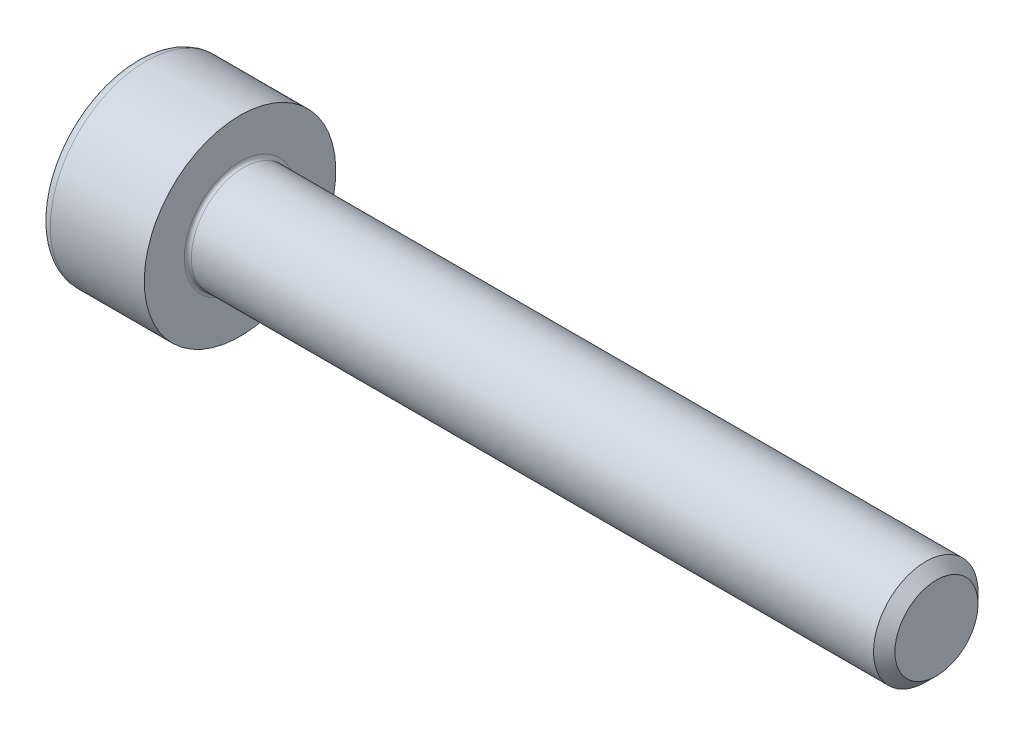
ISO-10303-21;
HEADER;
FILE_DESCRIPTION(('STEP AP214'),'2;1');
FILE_NAME('part.step','',(''),(''),'','','');
FILE_SCHEMA(('AUTOMOTIVE_DESIGN { 1 0 10303 214 1 1 1 1 }'));
ENDSEC;
DATA;
#1=APPLICATION_CONTEXT('core data for automotive mechanical design processes');
#2=APPLICATION_PROTOCOL_DEFINITION('international standard','automotive_design',2000,#1);
#3=PRODUCT_CONTEXT('',#1,'mechanical');
#4=PRODUCT('Part','Part','',(#3));
#5=PRODUCT_RELATED_PRODUCT_CATEGORY('part','',(#4));
#6=PRODUCT_DEFINITION_FORMATION('','',#4);
#7=PRODUCT_DEFINITION_CONTEXT('part definition',#1,'design');
#8=PRODUCT_DEFINITION('design','',#6,#7);
#9=PRODUCT_DEFINITION_SHAPE('','',#8);
#10=(LENGTH_UNIT() NAMED_UNIT(*) SI_UNIT(.MILLI.,.METRE.));
#11=(NAMED_UNIT(*) PLANE_ANGLE_UNIT() SI_UNIT($,.RADIAN.));
#12=(NAMED_UNIT(*) SI_UNIT($,.STERADIAN.) SOLID_ANGLE_UNIT());
#13=UNCERTAINTY_MEASURE_WITH_UNIT(LENGTH_MEASURE(1.E-05),#10,'distance_accuracy_value','');
#14=(GEOMETRIC_REPRESENTATION_CONTEXT(3) GLOBAL_UNCERTAINTY_ASSIGNED_CONTEXT((#13)) GLOBAL_UNIT_ASSIGNED_CONTEXT((#10,
#11,#12)) REPRESENTATION_CONTEXT('',''));
#15=CARTESIAN_POINT('',(0.,0.,0.));
#16=DIRECTION('',(0.,0.,1.));
#17=DIRECTION('',(1.,0.,0.));
#18=AXIS2_PLACEMENT_3D('',#15,#16,#17);
#19=CARTESIAN_POINT('',(-1.50499999995191,0.,0.));
#20=DIRECTION('',(-1.,0.,0.));
#21=DIRECTION('',(0.,0.,1.));
#22=AXIS2_PLACEMENT_3D('',#19,#20,#21);
#23=CONICAL_SURFACE('',#22,1.45203592694543,1.04719755118368);
#24=CARTESIAN_POINT('',(-0.666666666631954,0.,0.));
#25=VERTEX_POINT('',#24);
#26=VERTEX_LOOP('',#25);
#27=FACE_BOUND('',#26,.T.);
#28=CARTESIAN_POINT('',(-1.4999999999909,1.25,0.721687836489657));
#29=CARTESIAN_POINT('',(-1.4816847156944,1.25,0.658260217060659));
#30=CARTESIAN_POINT('',(-1.46502792317726,1.25,0.594285091323054));
#31=CARTESIAN_POINT('',(-1.43595399211371,1.25,0.465227153339786));
#32=CARTESIAN_POINT('',(-1.42354713769938,1.25,0.400142048730784));
#33=CARTESIAN_POINT('',(-1.40423497432866,1.25,0.270778406587784));
#34=CARTESIAN_POINT('',(-1.39720111723517,1.25,0.206519767732602));
#35=CARTESIAN_POINT('',(-1.38880573006833,1.25,0.0777002896417235));
#36=CARTESIAN_POINT('',(-1.38743724622064,1.25,0.0131399183085284));
#37=CARTESIAN_POINT('',(-1.39029143133364,1.25,-0.107484209657786));
#38=CARTESIAN_POINT('',(-1.3938133032472,1.25,-0.163566066924007));
#39=CARTESIAN_POINT('',(-1.40497331293631,1.25,-0.275364426449888));
#40=CARTESIAN_POINT('',(-1.41261525921817,1.25,-0.33108054231749));
#41=CARTESIAN_POINT('',(-1.43171864582492,1.25,-0.443109217007412));
#42=CARTESIAN_POINT('',(-1.44326102637533,1.25,-0.499407604241769));
#43=CARTESIAN_POINT('',(-1.46945735051443,1.25,-0.611164931123502));
#44=CARTESIAN_POINT('',(-1.48410514296048,1.25,-0.666625301406957));
#45=CARTESIAN_POINT('',(-1.4999999999909,1.25,-0.721687836489659));
#46=B_SPLINE_CURVE_WITH_KNOTS('',3,(#28,#29,#30,#31,#32,#33,#34,#35,#36,#37,#38,#39,#40,#41,#42,
#43,#44,#45),.UNSPECIFIED.,.F.,.F.,(4,2,2,2,2,2,2,2,4),(0.,0.198135007224197,0.39674613564431,
0.590442253848804,0.783900555565205,0.952317364149541,1.12089012112667,1.29320101406139,
1.4651737334536),.UNSPECIFIED.);
#47=CARTESIAN_POINT('',(-1.4999999999909,1.25000000000114,0.72168783648769));
#48=VERTEX_POINT('',#47);
#49=CARTESIAN_POINT('',(-1.49999999999052,1.25,-0.721687836488346));
#50=VERTEX_POINT('',#49);
#51=EDGE_CURVE('E20',#48,#50,#46,.T.);
#52=ORIENTED_EDGE('',*,*,#51,.T.);
#53=CARTESIAN_POINT('',(-1.4999999999909,1.25000000000227,-0.721687836485722));
#54=CARTESIAN_POINT('',(-1.4816847156944,1.19507007027519,-0.753401646200221));
#55=CARTESIAN_POINT('',(-1.46502792317726,1.13966598617612,-0.785389209069024));
#56=CARTESIAN_POINT('',(-1.43595399211371,1.02789853332257,-0.849918178060657));
#57=CARTESIAN_POINT('',(-1.42354713769938,0.971533179323208,-0.882460730365158));
#58=CARTESIAN_POINT('',(-1.40423497432866,0.859500978901291,-0.947142551436658));
#59=CARTESIAN_POINT('',(-1.39720111723517,0.803851365240094,-0.979271870864249));
#60=CARTESIAN_POINT('',(-1.38880573006833,0.69229042471114,-1.04368160990969));
#61=CARTESIAN_POINT('',(-1.38743724622064,0.636379503058836,-1.07596179557629));
#62=CARTESIAN_POINT('',(-1.39029143133364,0.531915943930663,-1.13627385955944));
#63=CARTESIAN_POINT('',(-1.3938133032472,0.483347630846703,-1.16431478819255));
#64=CARTESIAN_POINT('',(-1.40497331293631,0.386527411395864,-1.22021396795549));
#65=CARTESIAN_POINT('',(-1.41261525921817,0.338275839654324,-1.24807202588929));
#66=CARTESIAN_POINT('',(-1.43171864582492,0.241256161420549,-1.30408636323426));
#67=CARTESIAN_POINT('',(-1.44326102637533,0.192500327883502,-1.33223555685143));
#68=CARTESIAN_POINT('',(-1.46945735051443,0.0957156437448804,-1.3881142202923));
#69=CARTESIAN_POINT('',(-1.48410514296048,0.0476855541761164,-1.41584440543403));
#70=CARTESIAN_POINT('',(-1.4999999999909,-2.27522422515546E-12,-1.44337567297538));
#71=B_SPLINE_CURVE_WITH_KNOTS('',3,(#53,#54,#55,#56,#57,#58,#59,#60,#61,#62,#63,#64,#65,#66,#67,
#68,#69,#70),.UNSPECIFIED.,.F.,.F.,(4,2,2,2,2,2,2,2,4),(0.,0.198135007224197,0.39674613564431,
0.590442253848803,0.783900555565204,0.95231736414954,1.12089012112666,1.29320101406138,
1.46517373345359),.UNSPECIFIED.);
#72=CARTESIAN_POINT('',(-1.4999999999909,0.,-1.44337567297538));
#73=VERTEX_POINT('',#72);
#74=EDGE_CURVE('E81',#50,#73,#71,.T.);
#75=ORIENTED_EDGE('',*,*,#74,.T.);
#76=CARTESIAN_POINT('',(-1.4999999999909,2.27005244620297E-12,-1.44337567297538));
#77=CARTESIAN_POINT('',(-1.4816847156944,-0.0549299297248149,-1.41166186326088));
#78=CARTESIAN_POINT('',(-1.46502792317727,-0.110334013823884,-1.37967430039208));
#79=CARTESIAN_POINT('',(-1.43595399211371,-0.222101466677431,-1.31514533140045));
#80=CARTESIAN_POINT('',(-1.42354713769938,-0.278466820676794,-1.28260277909594));
#81=CARTESIAN_POINT('',(-1.40423497432866,-0.390499021098712,-1.21792095802444));
#82=CARTESIAN_POINT('',(-1.39720111723517,-0.446148634759909,-1.18579163859685));
#83=CARTESIAN_POINT('',(-1.38880573006834,-0.557709575288864,-1.12138189955141));
#84=CARTESIAN_POINT('',(-1.38743724622064,-0.613620496941167,-1.08910171388482));
#85=CARTESIAN_POINT('',(-1.39029143133364,-0.718084056069341,-1.02878964990166));
#86=CARTESIAN_POINT('',(-1.3938133032472,-0.7666523691533,-1.00074872126855));
#87=CARTESIAN_POINT('',(-1.40497331293632,-0.863472588604139,-0.944849541505608));
#88=CARTESIAN_POINT('',(-1.41261525921817,-0.911724160345678,-0.916991483571808));
#89=CARTESIAN_POINT('',(-1.43171864582492,-1.00874383857945,-0.860977146226847));
#90=CARTESIAN_POINT('',(-1.44326102637533,-1.0574996721165,-0.832827952609669));
#91=CARTESIAN_POINT('',(-1.46945735051443,-1.15428435625512,-0.776949289168803));
#92=CARTESIAN_POINT('',(-1.48410514296048,-1.20231444582388,-0.749219104027075));
#93=CARTESIAN_POINT('',(-1.4999999999909,-1.25000000000228,-0.721687836485724));
#94=B_SPLINE_CURVE_WITH_KNOTS('',3,(#76,#77,#78,#79,#80,#81,#82,#83,#84,#85,#86,#87,#88,#89,#90,
#91,#92,#93),.UNSPECIFIED.,.F.,.F.,(4,2,2,2,2,2,2,2,4),(0.,0.198135007224197,0.396746135644311,
0.590442253848805,0.783900555565207,0.952317364149541,1.12089012112666,1.29320101406138,
1.46517373345359),.UNSPECIFIED.);
#95=CARTESIAN_POINT('',(-1.4999999999909,-1.25000000000114,-0.721687836487692));
#96=VERTEX_POINT('',#95);
#97=EDGE_CURVE('E112',#73,#96,#94,.T.);
#98=ORIENTED_EDGE('',*,*,#97,.T.);
#99=CARTESIAN_POINT('',(-1.4999999999909,-1.25,-0.721687836489659));
#100=CARTESIAN_POINT('',(-1.4816847156944,-1.25,-0.65826021706066));
#101=CARTESIAN_POINT('',(-1.46502792317726,-1.25,-0.594285091323056));
#102=CARTESIAN_POINT('',(-1.43595399211371,-1.25,-0.465227153339788));
#103=CARTESIAN_POINT('',(-1.42354713769938,-1.25,-0.400142048730786));
#104=CARTESIAN_POINT('',(-1.40423497432866,-1.25,-0.270778406587786));
#105=CARTESIAN_POINT('',(-1.39720111723517,-1.25,-0.206519767732604));
#106=CARTESIAN_POINT('',(-1.38880573006833,-1.25,-0.0777002896417252));
#107=CARTESIAN_POINT('',(-1.38743724622064,-1.25,-0.0131399183085301));
#108=CARTESIAN_POINT('',(-1.39029143133364,-1.25,0.107484209657785));
#109=CARTESIAN_POINT('',(-1.3938133032472,-1.25,0.163566066924005));
#110=CARTESIAN_POINT('',(-1.40497331293631,-1.25,0.275364426449886));
#111=CARTESIAN_POINT('',(-1.41261525921817,-1.25,0.331080542317488));
#112=CARTESIAN_POINT('',(-1.43171864582492,-1.25,0.44310921700741));
#113=CARTESIAN_POINT('',(-1.44326102637533,-1.25,0.499407604241767));
#114=CARTESIAN_POINT('',(-1.46945735051443,-1.25,0.6111649311235));
#115=CARTESIAN_POINT('',(-1.48410514296048,-1.25,0.666625301406955));
#116=CARTESIAN_POINT('',(-1.4999999999909,-1.25,0.721687836489657));
#117=B_SPLINE_CURVE_WITH_KNOTS('',3,(#99,#100,#101,#102,#103,#104,#105,#106,#107,#108,#109,#110,
#111,#112,#113,#114,#115,#116),.UNSPECIFIED.,.F.,.F.,(4,2,2,2,2,2,2,2,4),(0.,0.198135007224197,
0.39674613564431,0.590442253848804,0.783900555565205,0.952317364149541,1.12089012112667,
1.29320101406139,1.4651737334536),.UNSPECIFIED.);
#118=CARTESIAN_POINT('',(-1.4999999999909,-1.25000000000114,0.721687836487689));
#119=VERTEX_POINT('',#118);
#120=EDGE_CURVE('E136',#96,#119,#117,.T.);
#121=ORIENTED_EDGE('',*,*,#120,.T.);
#122=CARTESIAN_POINT('',(-1.4999999999909,-1.25000000000227,0.72168783648572));
#123=CARTESIAN_POINT('',(-1.4816847156944,-1.19507007027519,0.75340164620022));
#124=CARTESIAN_POINT('',(-1.46502792317727,-1.13966598617612,0.785389209069022));
#125=CARTESIAN_POINT('',(-1.43595399211371,-1.02789853332257,0.849918178060656));
#126=CARTESIAN_POINT('',(-1.42354713769938,-0.97153317932321,0.882460730365157));
#127=CARTESIAN_POINT('',(-1.40423497432866,-0.859500978901293,0.947142551436657));
#128=CARTESIAN_POINT('',(-1.39720111723517,-0.803851365240095,0.979271870864248));
#129=CARTESIAN_POINT('',(-1.38880573006833,-0.692290424711142,1.04368160990969));
#130=CARTESIAN_POINT('',(-1.38743724622064,-0.636379503058838,1.07596179557629));
#131=CARTESIAN_POINT('',(-1.39029143133364,-0.531915943930664,1.13627385955944));
#132=CARTESIAN_POINT('',(-1.3938133032472,-0.483347630846704,1.16431478819255));
#133=CARTESIAN_POINT('',(-1.40497331293631,-0.386527411395865,1.22021396795549));
#134=CARTESIAN_POINT('',(-1.41261525921817,-0.338275839654325,1.24807202588929));
#135=CARTESIAN_POINT('',(-1.43171864582492,-0.24125616142055,1.30408636323425));
#136=CARTESIAN_POINT('',(-1.44326102637533,-0.192500327883503,1.33223555685143));
#137=CARTESIAN_POINT('',(-1.46945735051443,-0.0957156437448812,1.3881142202923));
#138=CARTESIAN_POINT('',(-1.48410514296048,-0.047685554176117,1.41584440543403));
#139=CARTESIAN_POINT('',(-1.4999999999909,2.27457887045116E-12,1.44337567297538));
#140=B_SPLINE_CURVE_WITH_KNOTS('',3,(#122,#123,#124,#125,#126,#127,#128,#129,#130,#131,#132,
#133,#134,#135,#136,#137,#138,#139),.UNSPECIFIED.,.F.,.F.,(4,2,2,2,2,2,2,2,4),(0.,
0.198135007224197,0.39674613564431,0.590442253848804,0.783900555565205,0.95231736414954,
1.12089012112667,1.29320101406139,1.4651737334536),.UNSPECIFIED.);
#141=CARTESIAN_POINT('',(-1.4999999999909,0.,1.44337567297538));
#142=VERTEX_POINT('',#141);
#143=EDGE_CURVE('E145',#119,#142,#140,.T.);
#144=ORIENTED_EDGE('',*,*,#143,.T.);
#145=CARTESIAN_POINT('',(-1.4999999999909,-2.27088715746638E-12,1.44337567297538));
#146=CARTESIAN_POINT('',(-1.4816847156944,0.0549299297248139,1.41166186326088));
#147=CARTESIAN_POINT('',(-1.46502792317727,0.110334013823883,1.37967430039208));
#148=CARTESIAN_POINT('',(-1.43595399211371,0.22210146667743,1.31514533140045));
#149=CARTESIAN_POINT('',(-1.42354713769938,0.278466820676793,1.28260277909594));
#150=CARTESIAN_POINT('',(-1.40423497432866,0.390499021098711,1.21792095802444));
#151=CARTESIAN_POINT('',(-1.39720111723517,0.446148634759908,1.18579163859685));
#152=CARTESIAN_POINT('',(-1.38880573006834,0.557709575288863,1.12138189955141));
#153=CARTESIAN_POINT('',(-1.38743724622064,0.613620496941166,1.08910171388481));
#154=CARTESIAN_POINT('',(-1.39029143133364,0.71808405606934,1.02878964990166));
#155=CARTESIAN_POINT('',(-1.3938133032472,0.766652369153299,1.00074872126855));
#156=CARTESIAN_POINT('',(-1.40497331293632,0.863472588604138,0.944849541505607));
#157=CARTESIAN_POINT('',(-1.41261525921817,0.911724160345677,0.916991483571806));
#158=CARTESIAN_POINT('',(-1.43171864582492,1.00874383857945,0.860977146226845));
#159=CARTESIAN_POINT('',(-1.44326102637533,1.0574996721165,0.832827952609667));
#160=CARTESIAN_POINT('',(-1.46945735051443,1.15428435625512,0.776949289168801));
#161=CARTESIAN_POINT('',(-1.48410514296048,1.20231444582388,0.749219104027073));
#162=CARTESIAN_POINT('',(-1.4999999999909,1.25000000000228,0.721687836485722));
#163=B_SPLINE_CURVE_WITH_KNOTS('',3,(#145,#146,#147,#148,#149,#150,#151,#152,#153,#154,#155,
#156,#157,#158,#159,#160,#161,#162),.UNSPECIFIED.,.F.,.F.,(4,2,2,2,2,2,2,2,4),(0.,
0.198135007224197,0.396746135644311,0.590442253848805,0.783900555565207,0.952317364149542,
1.12089012112667,1.29320101406138,1.46517373345359),.UNSPECIFIED.);
#164=EDGE_CURVE('E83',#142,#48,#163,.T.);
#165=ORIENTED_EDGE('',*,*,#164,.T.);
#166=EDGE_LOOP('',(#52,#75,#98,#121,#144,#165));
#167=FACE_BOUND('',#166,.T.);
#168=ADVANCED_FACE('F16',(#27,#167),#23,.F.);
#169=CARTESIAN_POINT('',(-2.99999999999999,1.25,0.721687836487031));
#170=DIRECTION('',(0.,1.,0.));
#171=DIRECTION('',(0.,0.,1.));
#172=AXIS2_PLACEMENT_3D('',#169,#170,#171);
#173=PLANE('',#172);
#174=DIRECTION('',(1.,0.,0.));
#175=VECTOR('',#174,1.);
#176=CARTESIAN_POINT('',(-2.99999999999999,1.25,0.721687836487034));
#177=LINE('',#176,#175);
#178=CARTESIAN_POINT('',(-2.99999999999999,1.25,0.721687836487032));
#179=VERTEX_POINT('',#178);
#180=EDGE_CURVE('E86',#48,#179,#177,.F.);
#181=ORIENTED_EDGE('',*,*,#180,.T.);
#182=DIRECTION('',(0.,0.,1.));
#183=VECTOR('',#182,1.);
#184=CARTESIAN_POINT('',(-2.99999999999999,1.25,0.));
#185=LINE('',#184,#183);
#186=CARTESIAN_POINT('',(-2.99999999999999,1.25,-0.721687836487033));
#187=VERTEX_POINT('',#186);
#188=EDGE_CURVE('E91',#187,#179,#185,.T.);
#189=ORIENTED_EDGE('',*,*,#188,.F.);
#190=DIRECTION('',(1.,0.,0.));
#191=VECTOR('',#190,1.);
#192=CARTESIAN_POINT('',(-2.99999999999999,1.25,-0.721687836487033));
#193=LINE('',#192,#191);
#194=EDGE_CURVE('E89',#187,#50,#193,.T.);
#195=ORIENTED_EDGE('',*,*,#194,.T.);
#196=ORIENTED_EDGE('',*,*,#51,.F.);
#197=EDGE_LOOP('',(#181,#189,#195,#196));
#198=FACE_BOUND('',#197,.T.);
#199=ADVANCED_FACE('F77',(#198),#173,.F.);
#200=CARTESIAN_POINT('',(-2.99999999999999,0.,1.44337567297407));
#201=DIRECTION('',(0.,0.500000000000001,0.866025403784438));
#202=DIRECTION('',(0.,-0.866025403784438,0.500000000000001));
#203=AXIS2_PLACEMENT_3D('',#200,#201,#202);
#204=PLANE('',#203);
#205=DIRECTION('',(1.,0.,0.));
#206=VECTOR('',#205,1.);
#207=CARTESIAN_POINT('',(-2.99999999999999,0.,1.44337567297407));
#208=LINE('',#207,#206);
#209=CARTESIAN_POINT('',(-2.99999999999999,0.,1.44337567297407));
#210=VERTEX_POINT('',#209);
#211=EDGE_CURVE('E150',#142,#210,#208,.F.);
#212=ORIENTED_EDGE('',*,*,#211,.T.);
#213=DIRECTION('',(0.,-0.866025403784437,0.500000000000004));
#214=VECTOR('',#213,1.);
#215=CARTESIAN_POINT('',(-2.99999999999999,1.25,0.721687836487031));
#216=LINE('',#215,#214);
#217=EDGE_CURVE('E102',#179,#210,#216,.T.);
#218=ORIENTED_EDGE('',*,*,#217,.F.);
#219=ORIENTED_EDGE('',*,*,#180,.F.);
#220=ORIENTED_EDGE('',*,*,#164,.F.);
#221=EDGE_LOOP('',(#212,#218,#219,#220));
#222=FACE_BOUND('',#221,.T.);
#223=ADVANCED_FACE('F155',(#222),#204,.F.);
#224=CARTESIAN_POINT('',(-2.99999999999999,-1.25,0.721687836487033));
#225=DIRECTION('',(0.,-0.5,0.866025403784439));
#226=DIRECTION('',(0.,-0.866025403784439,-0.5));
#227=AXIS2_PLACEMENT_3D('',#224,#225,#226);
#228=PLANE('',#227);
#229=DIRECTION('',(1.,0.,0.));
#230=VECTOR('',#229,1.);
#231=CARTESIAN_POINT('',(-2.99999999999999,-1.25,0.721687836487032));
#232=LINE('',#231,#230);
#233=CARTESIAN_POINT('',(-2.99999999999999,-1.25,0.721687836487032));
#234=VERTEX_POINT('',#233);
#235=EDGE_CURVE('E144',#119,#234,#232,.F.);
#236=ORIENTED_EDGE('',*,*,#235,.T.);
#237=DIRECTION('',(0.,-0.866025403784437,-0.500000000000003));
#238=VECTOR('',#237,1.);
#239=CARTESIAN_POINT('',(-2.99999999999999,0.,1.44337567297407));
#240=LINE('',#239,#238);
#241=EDGE_CURVE('E281',#210,#234,#240,.T.);
#242=ORIENTED_EDGE('',*,*,#241,.F.);
#243=ORIENTED_EDGE('',*,*,#211,.F.);
#244=ORIENTED_EDGE('',*,*,#143,.F.);
#245=EDGE_LOOP('',(#236,#242,#243,#244));
#246=FACE_BOUND('',#245,.T.);
#247=ADVANCED_FACE('F132',(#246),#228,.F.);
#248=CARTESIAN_POINT('',(-2.99999999999999,-1.25,-0.721687836487032));
#249=DIRECTION('',(0.,-1.,0.));
#250=DIRECTION('',(1.,0.,0.));
#251=AXIS2_PLACEMENT_3D('',#248,#249,#250);
#252=PLANE('',#251);
#253=DIRECTION('',(1.,0.,0.));
#254=VECTOR('',#253,1.);
#255=CARTESIAN_POINT('',(-2.99999999999999,-1.25,-0.721687836487037));
#256=LINE('',#255,#254);
#257=CARTESIAN_POINT('',(-2.99999999999999,-1.25,-0.721687836487034));
#258=VERTEX_POINT('',#257);
#259=EDGE_CURVE('E143',#96,#258,#256,.F.);
#260=ORIENTED_EDGE('',*,*,#259,.T.);
#261=DIRECTION('',(0.,0.,1.));
#262=VECTOR('',#261,1.);
#263=CARTESIAN_POINT('',(-2.99999999999999,-1.25,0.));
#264=LINE('',#263,#262);
#265=EDGE_CURVE('E275',#234,#258,#264,.F.);
#266=ORIENTED_EDGE('',*,*,#265,.F.);
#267=ORIENTED_EDGE('',*,*,#235,.F.);
#268=ORIENTED_EDGE('',*,*,#120,.F.);
#269=EDGE_LOOP('',(#260,#266,#267,#268));
#270=FACE_BOUND('',#269,.T.);
#271=ADVANCED_FACE('F128',(#270),#252,.F.);
#272=CARTESIAN_POINT('',(-2.99999999999999,0.,-1.44337567297407));
#273=DIRECTION('',(0.,-0.5,-0.866025403784439));
#274=DIRECTION('',(0.,0.866025403784439,-0.5));
#275=AXIS2_PLACEMENT_3D('',#272,#273,#274);
#276=PLANE('',#275);
#277=DIRECTION('',(1.,0.,0.));
#278=VECTOR('',#277,1.);
#279=CARTESIAN_POINT('',(-2.99999999999999,0.,-1.44337567297407));
#280=LINE('',#279,#278);
#281=CARTESIAN_POINT('',(-2.99999999999999,0.,-1.44337567297407));
#282=VERTEX_POINT('',#281);
#283=EDGE_CURVE('E39',#73,#282,#280,.F.);
#284=ORIENTED_EDGE('',*,*,#283,.T.);
#285=DIRECTION('',(0.,0.866025403784437,-0.500000000000003));
#286=VECTOR('',#285,1.);
#287=CARTESIAN_POINT('',(-2.99999999999999,-1.25,-0.721687836487032));
#288=LINE('',#287,#286);
#289=EDGE_CURVE('E269',#258,#282,#288,.T.);
#290=ORIENTED_EDGE('',*,*,#289,.F.);
#291=ORIENTED_EDGE('',*,*,#259,.F.);
#292=ORIENTED_EDGE('',*,*,#97,.F.);
#293=EDGE_LOOP('',(#284,#290,#291,#292));
#294=FACE_BOUND('',#293,.T.);
#295=ADVANCED_FACE('F122',(#294),#276,.F.);
#296=CARTESIAN_POINT('',(-2.99999999999999,1.25,-0.721687836487033));
#297=DIRECTION('',(0.,0.5,-0.866025403784439));
#298=DIRECTION('',(0.,0.866025403784439,0.5));
#299=AXIS2_PLACEMENT_3D('',#296,#297,#298);
#300=PLANE('',#299);
#301=ORIENTED_EDGE('',*,*,#194,.F.);
#302=DIRECTION('',(0.,0.866025403784437,0.500000000000002));
#303=VECTOR('',#302,1.);
#304=CARTESIAN_POINT('',(-2.99999999999999,0.,-1.44337567297407));
#305=LINE('',#304,#303);
#306=EDGE_CURVE('E266',#282,#187,#305,.T.);
#307=ORIENTED_EDGE('',*,*,#306,.F.);
#308=ORIENTED_EDGE('',*,*,#283,.F.);
#309=ORIENTED_EDGE('',*,*,#74,.F.);
#310=EDGE_LOOP('',(#301,#307,#308,#309));
#311=FACE_BOUND('',#310,.T.);
#312=ADVANCED_FACE('F96',(#311),#300,.F.);
#313=CARTESIAN_POINT('',(-2.99999999999999,2.09668783648703,0.));
#314=DIRECTION('',(-1.,0.,0.));
#315=DIRECTION('',(0.,-1.,0.));
#316=AXIS2_PLACEMENT_3D('',#313,#314,#315);
#317=PLANE('',#316);
#318=ORIENTED_EDGE('',*,*,#289,.T.);
#319=ORIENTED_EDGE('',*,*,#306,.T.);
#320=ORIENTED_EDGE('',*,*,#188,.T.);
#321=ORIENTED_EDGE('',*,*,#217,.T.);
#322=ORIENTED_EDGE('',*,*,#241,.T.);
#323=ORIENTED_EDGE('',*,*,#265,.T.);
#324=EDGE_LOOP('',(#318,#319,#320,#321,#322,#323));
#325=FACE_BOUND('',#324,.T.);
#326=CARTESIAN_POINT('',(-2.99999999999999,0.,0.));
#327=DIRECTION('',(1.,0.,0.));
#328=DIRECTION('',(0.,1.,0.));
#329=AXIS2_PLACEMENT_3D('',#326,#327,#328);
#330=CIRCLE('',#329,2.45);
#331=CARTESIAN_POINT('',(-2.99999999999999,2.45,0.));
#332=VERTEX_POINT('',#331);
#333=EDGE_CURVE('E225',#332,#332,#330,.T.);
#334=ORIENTED_EDGE('',*,*,#333,.F.);
#335=EDGE_LOOP('',(#334));
#336=FACE_BOUND('',#335,.T.);
#337=ADVANCED_FACE('F121',(#325,#336),#317,.T.);
#338=CARTESIAN_POINT('',(-2.69999999999999,0.,0.));
#339=DIRECTION('',(1.,0.,0.));
#340=DIRECTION('',(0.,0.,-1.));
#341=AXIS2_PLACEMENT_3D('',#338,#339,#340);
#342=TOROIDAL_SURFACE('',#341,2.45,0.3);
#343=CARTESIAN_POINT('',(-2.69999999999999,0.,0.));
#344=DIRECTION('',(1.,0.,0.));
#345=DIRECTION('',(0.,1.,0.));
#346=AXIS2_PLACEMENT_3D('',#343,#344,#345);
#347=CIRCLE('',#346,2.75);
#348=CARTESIAN_POINT('',(-2.69999999999999,2.75,0.));
#349=VERTEX_POINT('',#348);
#350=EDGE_CURVE('E302',#349,#349,#347,.T.);
#351=ORIENTED_EDGE('',*,*,#350,.F.);
#352=EDGE_LOOP('',(#351));
#353=FACE_BOUND('',#352,.T.);
#354=ORIENTED_EDGE('',*,*,#333,.T.);
#355=EDGE_LOOP('',(#354));
#356=FACE_BOUND('',#355,.T.);
#357=ADVANCED_FACE('F209',(#353,#356),#342,.T.);
#358=CARTESIAN_POINT('',(-1.49999999999999,0.,0.));
#359=DIRECTION('',(1.,0.,0.));
#360=DIRECTION('',(0.,1.,0.));
#361=AXIS2_PLACEMENT_3D('',#358,#359,#360);
#362=CYLINDRICAL_SURFACE('',#361,2.75);
#363=ORIENTED_EDGE('',*,*,#350,.T.);
#364=EDGE_LOOP('',(#363));
#365=FACE_BOUND('',#364,.T.);
#366=CARTESIAN_POINT('',(0.,0.,0.));
#367=DIRECTION('',(1.,0.,0.));
#368=DIRECTION('',(0.,1.,0.));
#369=AXIS2_PLACEMENT_3D('',#366,#367,#368);
#370=CIRCLE('',#369,2.75);
#371=CARTESIAN_POINT('',(0.,2.75,0.));
#372=VERTEX_POINT('',#371);
#373=EDGE_CURVE('E110',#372,#372,#370,.T.);
#374=ORIENTED_EDGE('',*,*,#373,.F.);
#375=EDGE_LOOP('',(#374));
#376=FACE_BOUND('',#375,.T.);
#377=ADVANCED_FACE('F206',(#365,#376),#362,.T.);
#378=CARTESIAN_POINT('',(20.,0.75,0.));
#379=DIRECTION('',(1.,0.,0.));
#380=DIRECTION('',(0.,1.,0.));
#381=AXIS2_PLACEMENT_3D('',#378,#379,#380);
#382=PLANE('',#381);
#383=CARTESIAN_POINT('',(19.9999999999818,0.,0.));
#384=DIRECTION('',(-1.,0.,0.));
#385=DIRECTION('',(0.,0.,1.));
#386=AXIS2_PLACEMENT_3D('',#383,#384,#385);
#387=CIRCLE('',#386,1.19327499999144);
#388=CARTESIAN_POINT('',(19.9999999999818,0.,1.19327499999144));
#389=VERTEX_POINT('',#388);
#390=EDGE_CURVE('E293',#389,#389,#387,.T.);
#391=ORIENTED_EDGE('',*,*,#390,.F.);
#392=EDGE_LOOP('',(#391));
#393=FACE_BOUND('',#392,.T.);
#394=ADVANCED_FACE('F203',(#393),#382,.T.);
#395=CARTESIAN_POINT('',(0.,2.125,0.));
#396=DIRECTION('',(1.,0.,0.));
#397=DIRECTION('',(0.,1.,0.));
#398=AXIS2_PLACEMENT_3D('',#395,#396,#397);
#399=PLANE('',#398);
#400=CARTESIAN_POINT('',(0.,0.,0.));
#401=DIRECTION('',(1.,0.,0.));
#402=DIRECTION('',(0.,1.,0.));
#403=AXIS2_PLACEMENT_3D('',#400,#401,#402);
#404=CIRCLE('',#403,1.6);
#405=CARTESIAN_POINT('',(0.,1.6,0.));
#406=VERTEX_POINT('',#405);
#407=EDGE_CURVE('E190',#406,#406,#404,.F.);
#408=ORIENTED_EDGE('',*,*,#407,.T.);
#409=EDGE_LOOP('',(#408));
#410=FACE_BOUND('',#409,.T.);
#411=ORIENTED_EDGE('',*,*,#373,.T.);
#412=EDGE_LOOP('',(#411));
#413=FACE_BOUND('',#412,.T.);
#414=ADVANCED_FACE('F194',(#410,#413),#399,.T.);
#415=CARTESIAN_POINT('',(19.6932750000087,0.,0.));
#416=DIRECTION('',(-1.,0.,0.));
#417=DIRECTION('',(0.,0.,1.));
#418=AXIS2_PLACEMENT_3D('',#415,#416,#417);
#419=CONICAL_SURFACE('',#418,1.49999999996453,0.785398163397448);
#420=ORIENTED_EDGE('',*,*,#390,.T.);
#421=EDGE_LOOP('',(#420));
#422=FACE_BOUND('',#421,.T.);
#423=CARTESIAN_POINT('',(19.693275,0.,0.));
#424=DIRECTION('',(1.,0.,0.));
#425=DIRECTION('',(0.,1.,0.));
#426=AXIS2_PLACEMENT_3D('',#423,#424,#425);
#427=CIRCLE('',#426,1.5);
#428=CARTESIAN_POINT('',(19.693275,1.5,0.));
#429=VERTEX_POINT('',#428);
#430=EDGE_CURVE('E30',#429,#429,#427,.F.);
#431=ORIENTED_EDGE('',*,*,#430,.F.);
#432=EDGE_LOOP('',(#431));
#433=FACE_BOUND('',#432,.T.);
#434=ADVANCED_FACE('F172',(#422,#433),#419,.T.);
#435=CARTESIAN_POINT('',(0.100000000000002,0.,0.));
#436=DIRECTION('',(1.,0.,0.));
#437=DIRECTION('',(0.,0.,-1.));
#438=AXIS2_PLACEMENT_3D('',#435,#436,#437);
#439=TOROIDAL_SURFACE('',#438,1.6,0.1);
#440=CARTESIAN_POINT('',(0.100000000000003,0.,0.));
#441=DIRECTION('',(1.,0.,0.));
#442=DIRECTION('',(0.,1.,0.));
#443=AXIS2_PLACEMENT_3D('',#440,#441,#442);
#444=CIRCLE('',#443,1.5);
#445=CARTESIAN_POINT('',(0.100000000000003,1.5,0.));
#446=VERTEX_POINT('',#445);
#447=EDGE_CURVE('E11',#446,#446,#444,.T.);
#448=ORIENTED_EDGE('',*,*,#447,.F.);
#449=EDGE_LOOP('',(#448));
#450=FACE_BOUND('',#449,.T.);
#451=ORIENTED_EDGE('',*,*,#407,.F.);
#452=EDGE_LOOP('',(#451));
#453=FACE_BOUND('',#452,.T.);
#454=ADVANCED_FACE('F166',(#450,#453),#439,.F.);
#455=CARTESIAN_POINT('',(10.456725,0.,0.));
#456=DIRECTION('',(1.,0.,0.));
#457=DIRECTION('',(0.,1.,0.));
#458=AXIS2_PLACEMENT_3D('',#455,#456,#457);
#459=CYLINDRICAL_SURFACE('',#458,1.5);
#460=ORIENTED_EDGE('',*,*,#447,.T.);
#461=EDGE_LOOP('',(#460));
#462=FACE_BOUND('',#461,.T.);
#463=ORIENTED_EDGE('',*,*,#430,.T.);
#464=EDGE_LOOP('',(#463));
#465=FACE_BOUND('',#464,.T.);
#466=ADVANCED_FACE('F164',(#462,#465),#459,.T.);
#467=CLOSED_SHELL('',(#168,#199,#223,#247,#271,#295,#312,#337,#357,#377,#394,#414,#434,#454,#466));
#468=MANIFOLD_SOLID_BREP('B1',#467);
#469=ADVANCED_BREP_SHAPE_REPRESENTATION('',(#18,#468),#14);
#470=SHAPE_DEFINITION_REPRESENTATION(#9,#469);
ENDSEC;
END-ISO-10303-21;
